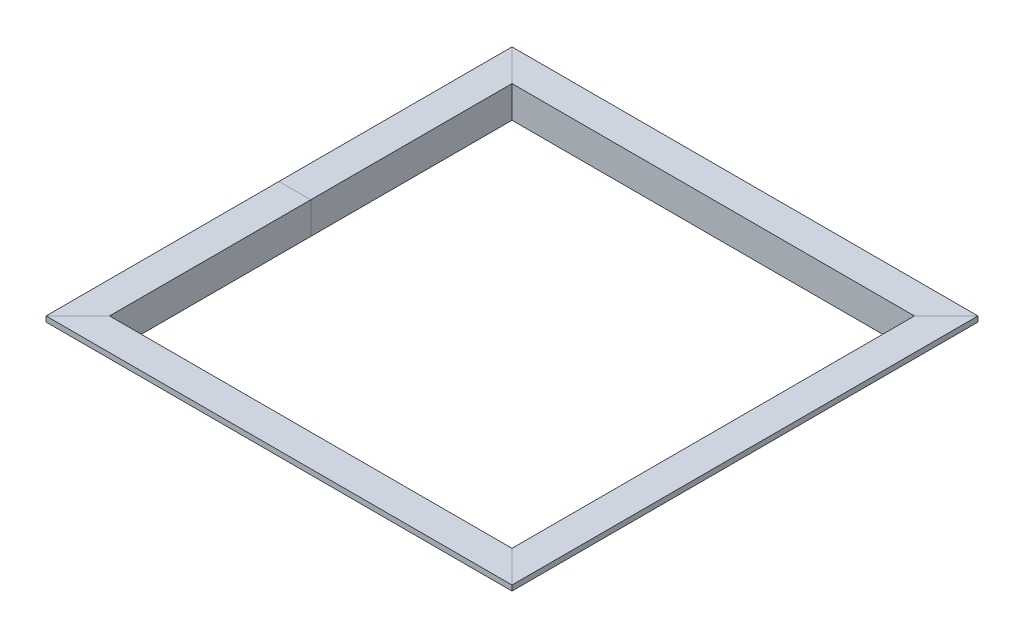
ISO-10303-21;
HEADER;
FILE_DESCRIPTION(('STEP AP214'),'2;1');
FILE_NAME('part.step','',(''),(''),'','','');
FILE_SCHEMA(('AUTOMOTIVE_DESIGN { 1 0 10303 214 1 1 1 1 }'));
ENDSEC;
DATA;
#1=APPLICATION_CONTEXT('core data for automotive mechanical design processes');
#2=APPLICATION_PROTOCOL_DEFINITION('international standard','automotive_design',2000,#1);
#3=PRODUCT_CONTEXT('',#1,'mechanical');
#4=PRODUCT('Part','Part','',(#3));
#5=PRODUCT_RELATED_PRODUCT_CATEGORY('part','',(#4));
#6=PRODUCT_DEFINITION_FORMATION('','',#4);
#7=PRODUCT_DEFINITION_CONTEXT('part definition',#1,'design');
#8=PRODUCT_DEFINITION('design','',#6,#7);
#9=PRODUCT_DEFINITION_SHAPE('','',#8);
#10=(LENGTH_UNIT() NAMED_UNIT(*) SI_UNIT(.MILLI.,.METRE.));
#11=(NAMED_UNIT(*) PLANE_ANGLE_UNIT() SI_UNIT($,.RADIAN.));
#12=(NAMED_UNIT(*) SI_UNIT($,.STERADIAN.) SOLID_ANGLE_UNIT());
#13=UNCERTAINTY_MEASURE_WITH_UNIT(LENGTH_MEASURE(1.E-05),#10,'distance_accuracy_value','');
#14=(GEOMETRIC_REPRESENTATION_CONTEXT(3) GLOBAL_UNCERTAINTY_ASSIGNED_CONTEXT((#13)) GLOBAL_UNIT_ASSIGNED_CONTEXT((#10,
#11,#12)) REPRESENTATION_CONTEXT('',''));
#15=CARTESIAN_POINT('',(0.,0.,0.));
#16=DIRECTION('',(0.,0.,1.));
#17=DIRECTION('',(1.,0.,0.));
#18=AXIS2_PLACEMENT_3D('',#15,#16,#17);
#19=CARTESIAN_POINT('',(279.4,-6.35,279.4));
#20=DIRECTION('',(0.,0.,-1.));
#21=DIRECTION('',(-1.,0.,0.));
#22=AXIS2_PLACEMENT_3D('',#19,#20,#21);
#23=PLANE('',#22);
#24=DIRECTION('',(-1.,0.,0.));
#25=VECTOR('',#24,1.);
#26=CARTESIAN_POINT('',(279.4,-6.35,279.4));
#27=LINE('',#26,#25);
#28=CARTESIAN_POINT('',(279.4,-6.35,279.4));
#29=VERTEX_POINT('',#28);
#30=CARTESIAN_POINT('',(-279.4,-6.35,279.4));
#31=VERTEX_POINT('',#30);
#32=EDGE_CURVE('E178',#29,#31,#27,.T.);
#33=ORIENTED_EDGE('',*,*,#32,.F.);
#34=DIRECTION('',(0.,-1.,0.));
#35=VECTOR('',#34,1.);
#36=CARTESIAN_POINT('',(279.4,-6.35,279.4));
#37=LINE('',#36,#35);
#38=CARTESIAN_POINT('',(279.4,0.,279.4));
#39=VERTEX_POINT('',#38);
#40=EDGE_CURVE('E253',#39,#29,#37,.T.);
#41=ORIENTED_EDGE('',*,*,#40,.F.);
#42=DIRECTION('',(-1.,0.,0.));
#43=VECTOR('',#42,1.);
#44=CARTESIAN_POINT('',(279.4,0.,279.4));
#45=LINE('',#44,#43);
#46=CARTESIAN_POINT('',(-279.4,0.,279.4));
#47=VERTEX_POINT('',#46);
#48=EDGE_CURVE('E136',#39,#47,#45,.T.);
#49=ORIENTED_EDGE('',*,*,#48,.T.);
#50=DIRECTION('',(0.,-1.,0.));
#51=VECTOR('',#50,1.);
#52=CARTESIAN_POINT('',(-279.4,-6.35,279.4));
#53=LINE('',#52,#51);
#54=EDGE_CURVE('E175',#47,#31,#53,.T.);
#55=ORIENTED_EDGE('',*,*,#54,.T.);
#56=EDGE_LOOP('',(#33,#41,#49,#55));
#57=FACE_BOUND('',#56,.T.);
#58=ADVANCED_FACE('F33',(#57),#23,.F.);
#59=CARTESIAN_POINT('',(279.4,-38.1,247.65));
#60=DIRECTION('',(0.,0.,-1.));
#61=DIRECTION('',(-1.,0.,0.));
#62=AXIS2_PLACEMENT_3D('',#59,#60,#61);
#63=PLANE('',#62);
#64=DIRECTION('',(-1.,0.,0.));
#65=VECTOR('',#64,1.);
#66=CARTESIAN_POINT('',(279.4,-38.1,247.65));
#67=LINE('',#66,#65);
#68=CARTESIAN_POINT('',(247.65,-38.1,247.65));
#69=VERTEX_POINT('',#68);
#70=CARTESIAN_POINT('',(-247.65,-38.1,247.65));
#71=VERTEX_POINT('',#70);
#72=EDGE_CURVE('E207',#69,#71,#67,.T.);
#73=ORIENTED_EDGE('',*,*,#72,.F.);
#74=DIRECTION('',(0.,1.,0.));
#75=VECTOR('',#74,1.);
#76=CARTESIAN_POINT('',(247.65,-38.1,247.65));
#77=LINE('',#76,#75);
#78=CARTESIAN_POINT('',(247.65,-6.35,247.65));
#79=VERTEX_POINT('',#78);
#80=EDGE_CURVE('E241',#69,#79,#77,.T.);
#81=ORIENTED_EDGE('',*,*,#80,.T.);
#82=DIRECTION('',(-1.,0.,0.));
#83=VECTOR('',#82,1.);
#84=CARTESIAN_POINT('',(279.4,-6.35,247.65));
#85=LINE('',#84,#83);
#86=CARTESIAN_POINT('',(-247.65,-6.35,247.65));
#87=VERTEX_POINT('',#86);
#88=EDGE_CURVE('E204',#79,#87,#85,.T.);
#89=ORIENTED_EDGE('',*,*,#88,.T.);
#90=DIRECTION('',(0.,1.,0.));
#91=VECTOR('',#90,1.);
#92=CARTESIAN_POINT('',(-247.65,-38.1,247.65));
#93=LINE('',#92,#91);
#94=EDGE_CURVE('E155',#71,#87,#93,.T.);
#95=ORIENTED_EDGE('',*,*,#94,.F.);
#96=EDGE_LOOP('',(#73,#81,#89,#95));
#97=FACE_BOUND('',#96,.T.);
#98=ADVANCED_FACE('F220',(#97),#63,.F.);
#99=CARTESIAN_POINT('',(279.4,-38.1,241.3));
#100=DIRECTION('',(0.,1.,0.));
#101=DIRECTION('',(0.,0.,1.));
#102=AXIS2_PLACEMENT_3D('',#99,#100,#101);
#103=PLANE('',#102);
#104=DIRECTION('',(-1.,0.,0.));
#105=VECTOR('',#104,1.);
#106=CARTESIAN_POINT('',(279.4,-38.1,241.3));
#107=LINE('',#106,#105);
#108=CARTESIAN_POINT('',(241.3,-38.1,241.3));
#109=VERTEX_POINT('',#108);
#110=CARTESIAN_POINT('',(-241.3,-38.1,241.3));
#111=VERTEX_POINT('',#110);
#112=EDGE_CURVE('E137',#109,#111,#107,.T.);
#113=ORIENTED_EDGE('',*,*,#112,.F.);
#114=DIRECTION('',(0.707106781186548,0.,0.707106781186548));
#115=VECTOR('',#114,1.);
#116=CARTESIAN_POINT('',(-19.05,-38.0999999999997,-19.0500000000002));
#117=LINE('',#116,#115);
#118=EDGE_CURVE('E215',#109,#69,#117,.T.);
#119=ORIENTED_EDGE('',*,*,#118,.T.);
#120=ORIENTED_EDGE('',*,*,#72,.T.);
#121=DIRECTION('',(-0.707106781186547,0.,0.707106781186548));
#122=VECTOR('',#121,1.);
#123=CARTESIAN_POINT('',(-260.35,-38.1,260.35));
#124=LINE('',#123,#122);
#125=EDGE_CURVE('E141',#111,#71,#124,.T.);
#126=ORIENTED_EDGE('',*,*,#125,.F.);
#127=EDGE_LOOP('',(#113,#119,#120,#126));
#128=FACE_BOUND('',#127,.T.);
#129=ADVANCED_FACE('F213',(#128),#103,.F.);
#130=CARTESIAN_POINT('',(279.4,0.,241.3));
#131=DIRECTION('',(0.,0.,1.));
#132=DIRECTION('',(0.,-1.,0.));
#133=AXIS2_PLACEMENT_3D('',#130,#131,#132);
#134=PLANE('',#133);
#135=DIRECTION('',(-1.,0.,0.));
#136=VECTOR('',#135,1.);
#137=CARTESIAN_POINT('',(279.4,0.,241.3));
#138=LINE('',#137,#136);
#139=CARTESIAN_POINT('',(241.3,0.,241.3));
#140=VERTEX_POINT('',#139);
#141=CARTESIAN_POINT('',(-241.3,0.,241.3));
#142=VERTEX_POINT('',#141);
#143=EDGE_CURVE('E37',#140,#142,#138,.T.);
#144=ORIENTED_EDGE('',*,*,#143,.F.);
#145=DIRECTION('',(0.,-1.,0.));
#146=VECTOR('',#145,1.);
#147=CARTESIAN_POINT('',(241.3,-3.79326200080262E-13,241.3));
#148=LINE('',#147,#146);
#149=EDGE_CURVE('E246',#140,#109,#148,.T.);
#150=ORIENTED_EDGE('',*,*,#149,.T.);
#151=ORIENTED_EDGE('',*,*,#112,.T.);
#152=DIRECTION('',(0.,-1.,0.));
#153=VECTOR('',#152,1.);
#154=CARTESIAN_POINT('',(-241.3,0.,241.3));
#155=LINE('',#154,#153);
#156=EDGE_CURVE('E111',#142,#111,#155,.T.);
#157=ORIENTED_EDGE('',*,*,#156,.F.);
#158=EDGE_LOOP('',(#144,#150,#151,#157));
#159=FACE_BOUND('',#158,.T.);
#160=ADVANCED_FACE('F138',(#159),#134,.F.);
#161=CARTESIAN_POINT('',(279.4,0.,279.4));
#162=DIRECTION('',(0.,-1.,0.));
#163=DIRECTION('',(0.,0.,-1.));
#164=AXIS2_PLACEMENT_3D('',#161,#162,#163);
#165=PLANE('',#164);
#166=ORIENTED_EDGE('',*,*,#48,.F.);
#167=DIRECTION('',(-0.707106781186548,0.,-0.707106781186548));
#168=VECTOR('',#167,1.);
#169=CARTESIAN_POINT('',(0.,0.,-1.66533453693773E-13));
#170=LINE('',#169,#168);
#171=EDGE_CURVE('E132',#39,#140,#170,.T.);
#172=ORIENTED_EDGE('',*,*,#171,.T.);
#173=ORIENTED_EDGE('',*,*,#143,.T.);
#174=DIRECTION('',(0.707106781186547,0.,-0.707106781186548));
#175=VECTOR('',#174,1.);
#176=CARTESIAN_POINT('',(-279.4,0.,279.4));
#177=LINE('',#176,#175);
#178=EDGE_CURVE('E117',#47,#142,#177,.T.);
#179=ORIENTED_EDGE('',*,*,#178,.F.);
#180=EDGE_LOOP('',(#166,#172,#173,#179));
#181=FACE_BOUND('',#180,.T.);
#182=ADVANCED_FACE('F131',(#181),#165,.F.);
#183=CARTESIAN_POINT('',(279.4,-6.35,247.65));
#184=DIRECTION('',(0.,1.,0.));
#185=DIRECTION('',(0.,0.,1.));
#186=AXIS2_PLACEMENT_3D('',#183,#184,#185);
#187=PLANE('',#186);
#188=ORIENTED_EDGE('',*,*,#88,.F.);
#189=DIRECTION('',(0.707106781186548,0.,0.707106781186548));
#190=VECTOR('',#189,1.);
#191=CARTESIAN_POINT('',(-15.875,-6.34999999999996,-15.8750000000002));
#192=LINE('',#191,#190);
#193=EDGE_CURVE('E127',#79,#29,#192,.T.);
#194=ORIENTED_EDGE('',*,*,#193,.T.);
#195=ORIENTED_EDGE('',*,*,#32,.T.);
#196=DIRECTION('',(-0.707106781186547,0.,0.707106781186548));
#197=VECTOR('',#196,1.);
#198=CARTESIAN_POINT('',(-263.525,-6.35,263.525));
#199=LINE('',#198,#197);
#200=EDGE_CURVE('E157',#87,#31,#199,.T.);
#201=ORIENTED_EDGE('',*,*,#200,.F.);
#202=EDGE_LOOP('',(#188,#194,#195,#201));
#203=FACE_BOUND('',#202,.T.);
#204=ADVANCED_FACE('F35',(#203),#187,.F.);
#205=CARTESIAN_POINT('',(-247.65,-38.1,279.4));
#206=DIRECTION('',(1.,0.,0.));
#207=DIRECTION('',(0.,0.,-1.));
#208=AXIS2_PLACEMENT_3D('',#205,#206,#207);
#209=PLANE('',#208);
#210=ORIENTED_EDGE('',*,*,#94,.T.);
#211=DIRECTION('',(0.,0.,-1.));
#212=VECTOR('',#211,1.);
#213=CARTESIAN_POINT('',(-247.65,-6.35,279.4));
#214=LINE('',#213,#212);
#215=CARTESIAN_POINT('',(-247.65,-6.35,0.));
#216=VERTEX_POINT('',#215);
#217=EDGE_CURVE('E165',#87,#216,#214,.T.);
#218=ORIENTED_EDGE('',*,*,#217,.T.);
#219=DIRECTION('',(0.,-1.,0.));
#220=VECTOR('',#219,1.);
#221=CARTESIAN_POINT('',(-247.65,-38.1,0.));
#222=LINE('',#221,#220);
#223=CARTESIAN_POINT('',(-247.65,-38.1,0.));
#224=VERTEX_POINT('',#223);
#225=EDGE_CURVE('E161',#216,#224,#222,.T.);
#226=ORIENTED_EDGE('',*,*,#225,.T.);
#227=DIRECTION('',(0.,0.,-1.));
#228=VECTOR('',#227,1.);
#229=CARTESIAN_POINT('',(-247.65,-38.1,279.4));
#230=LINE('',#229,#228);
#231=EDGE_CURVE('E164',#71,#224,#230,.T.);
#232=ORIENTED_EDGE('',*,*,#231,.F.);
#233=EDGE_LOOP('',(#210,#218,#226,#232));
#234=FACE_BOUND('',#233,.T.);
#235=ADVANCED_FACE('F224',(#234),#209,.F.);
#236=CARTESIAN_POINT('',(-241.3,-38.1,279.4));
#237=DIRECTION('',(0.,1.,0.));
#238=DIRECTION('',(-1.,0.,0.));
#239=AXIS2_PLACEMENT_3D('',#236,#237,#238);
#240=PLANE('',#239);
#241=ORIENTED_EDGE('',*,*,#125,.T.);
#242=ORIENTED_EDGE('',*,*,#231,.T.);
#243=DIRECTION('',(1.,0.,0.));
#244=VECTOR('',#243,1.);
#245=CARTESIAN_POINT('',(-241.3,-38.1,0.));
#246=LINE('',#245,#244);
#247=CARTESIAN_POINT('',(-241.3,-38.1,0.));
#248=VERTEX_POINT('',#247);
#249=EDGE_CURVE('E166',#224,#248,#246,.T.);
#250=ORIENTED_EDGE('',*,*,#249,.T.);
#251=DIRECTION('',(0.,0.,-1.));
#252=VECTOR('',#251,1.);
#253=CARTESIAN_POINT('',(-241.3,-38.1,279.4));
#254=LINE('',#253,#252);
#255=EDGE_CURVE('E150',#111,#248,#254,.T.);
#256=ORIENTED_EDGE('',*,*,#255,.F.);
#257=EDGE_LOOP('',(#241,#242,#250,#256));
#258=FACE_BOUND('',#257,.T.);
#259=ADVANCED_FACE('F423',(#258),#240,.F.);
#260=CARTESIAN_POINT('',(-241.3,0.,279.4));
#261=DIRECTION('',(-1.,0.,0.));
#262=DIRECTION('',(0.,-1.,0.));
#263=AXIS2_PLACEMENT_3D('',#260,#261,#262);
#264=PLANE('',#263);
#265=ORIENTED_EDGE('',*,*,#156,.T.);
#266=ORIENTED_EDGE('',*,*,#255,.T.);
#267=DIRECTION('',(0.,1.,0.));
#268=VECTOR('',#267,1.);
#269=CARTESIAN_POINT('',(-241.3,0.,0.));
#270=LINE('',#269,#268);
#271=CARTESIAN_POINT('',(-241.3,0.,0.));
#272=VERTEX_POINT('',#271);
#273=EDGE_CURVE('E146',#248,#272,#270,.T.);
#274=ORIENTED_EDGE('',*,*,#273,.T.);
#275=DIRECTION('',(0.,0.,-1.));
#276=VECTOR('',#275,1.);
#277=CARTESIAN_POINT('',(-241.3,0.,279.4));
#278=LINE('',#277,#276);
#279=EDGE_CURVE('E121',#142,#272,#278,.T.);
#280=ORIENTED_EDGE('',*,*,#279,.F.);
#281=EDGE_LOOP('',(#265,#266,#274,#280));
#282=FACE_BOUND('',#281,.T.);
#283=ADVANCED_FACE('F144',(#282),#264,.F.);
#284=CARTESIAN_POINT('',(-279.4,0.,279.4));
#285=DIRECTION('',(0.,-1.,0.));
#286=DIRECTION('',(0.,0.,-1.));
#287=AXIS2_PLACEMENT_3D('',#284,#285,#286);
#288=PLANE('',#287);
#289=ORIENTED_EDGE('',*,*,#178,.T.);
#290=ORIENTED_EDGE('',*,*,#279,.T.);
#291=DIRECTION('',(-1.,0.,0.));
#292=VECTOR('',#291,1.);
#293=CARTESIAN_POINT('',(-279.4,0.,0.));
#294=LINE('',#293,#292);
#295=CARTESIAN_POINT('',(-279.4,0.,0.));
#296=VERTEX_POINT('',#295);
#297=EDGE_CURVE('E147',#272,#296,#294,.T.);
#298=ORIENTED_EDGE('',*,*,#297,.T.);
#299=DIRECTION('',(0.,0.,-1.));
#300=VECTOR('',#299,1.);
#301=CARTESIAN_POINT('',(-279.4,0.,279.4));
#302=LINE('',#301,#300);
#303=EDGE_CURVE('E124',#47,#296,#302,.T.);
#304=ORIENTED_EDGE('',*,*,#303,.F.);
#305=EDGE_LOOP('',(#289,#290,#298,#304));
#306=FACE_BOUND('',#305,.T.);
#307=ADVANCED_FACE('F119',(#306),#288,.F.);
#308=CARTESIAN_POINT('',(-279.4,-6.35,279.4));
#309=DIRECTION('',(1.,0.,0.));
#310=DIRECTION('',(0.,0.,-1.));
#311=AXIS2_PLACEMENT_3D('',#308,#309,#310);
#312=PLANE('',#311);
#313=DIRECTION('',(0.,0.,-1.));
#314=VECTOR('',#313,1.);
#315=CARTESIAN_POINT('',(-279.4,-6.35,279.4));
#316=LINE('',#315,#314);
#317=CARTESIAN_POINT('',(-279.4,-6.35,0.));
#318=VERTEX_POINT('',#317);
#319=EDGE_CURVE('E181',#31,#318,#316,.T.);
#320=ORIENTED_EDGE('',*,*,#319,.F.);
#321=ORIENTED_EDGE('',*,*,#54,.F.);
#322=ORIENTED_EDGE('',*,*,#303,.T.);
#323=DIRECTION('',(0.,-1.,0.));
#324=VECTOR('',#323,1.);
#325=CARTESIAN_POINT('',(-279.4,-6.35,0.));
#326=LINE('',#325,#324);
#327=EDGE_CURVE('E170',#296,#318,#326,.T.);
#328=ORIENTED_EDGE('',*,*,#327,.T.);
#329=EDGE_LOOP('',(#320,#321,#322,#328));
#330=FACE_BOUND('',#329,.T.);
#331=ADVANCED_FACE('F386',(#330),#312,.F.);
#332=CARTESIAN_POINT('',(-247.65,-6.35,279.4));
#333=DIRECTION('',(0.,1.,0.));
#334=DIRECTION('',(-1.,0.,0.));
#335=AXIS2_PLACEMENT_3D('',#332,#333,#334);
#336=PLANE('',#335);
#337=ORIENTED_EDGE('',*,*,#200,.T.);
#338=ORIENTED_EDGE('',*,*,#319,.T.);
#339=DIRECTION('',(1.,0.,0.));
#340=VECTOR('',#339,1.);
#341=CARTESIAN_POINT('',(-247.65,-6.35,0.));
#342=LINE('',#341,#340);
#343=EDGE_CURVE('E184',#318,#216,#342,.T.);
#344=ORIENTED_EDGE('',*,*,#343,.T.);
#345=ORIENTED_EDGE('',*,*,#217,.F.);
#346=EDGE_LOOP('',(#337,#338,#344,#345));
#347=FACE_BOUND('',#346,.T.);
#348=ADVANCED_FACE('F383',(#347),#336,.F.);
#349=CARTESIAN_POINT('',(-279.4,-6.35,0.));
#350=DIRECTION('',(1.,0.,0.));
#351=DIRECTION('',(0.,0.,-1.));
#352=AXIS2_PLACEMENT_3D('',#349,#350,#351);
#353=PLANE('',#352);
#354=DIRECTION('',(0.,0.,-1.));
#355=VECTOR('',#354,1.);
#356=CARTESIAN_POINT('',(-279.4,-6.35,0.));
#357=LINE('',#356,#355);
#358=CARTESIAN_POINT('',(-279.4,-6.35,-279.4));
#359=VERTEX_POINT('',#358);
#360=EDGE_CURVE('E160',#318,#359,#357,.T.);
#361=ORIENTED_EDGE('',*,*,#360,.F.);
#362=ORIENTED_EDGE('',*,*,#327,.F.);
#363=DIRECTION('',(0.,0.,-1.));
#364=VECTOR('',#363,1.);
#365=CARTESIAN_POINT('',(-279.4,0.,0.));
#366=LINE('',#365,#364);
#367=CARTESIAN_POINT('',(-279.4,0.,-279.4));
#368=VERTEX_POINT('',#367);
#369=EDGE_CURVE('E171',#296,#368,#366,.T.);
#370=ORIENTED_EDGE('',*,*,#369,.T.);
#371=DIRECTION('',(0.,-1.,0.));
#372=VECTOR('',#371,1.);
#373=CARTESIAN_POINT('',(-279.4,-6.35,-279.4));
#374=LINE('',#373,#372);
#375=EDGE_CURVE('E269',#368,#359,#374,.T.);
#376=ORIENTED_EDGE('',*,*,#375,.T.);
#377=EDGE_LOOP('',(#361,#362,#370,#376));
#378=FACE_BOUND('',#377,.T.);
#379=ADVANCED_FACE('F370',(#378),#353,.F.);
#380=CARTESIAN_POINT('',(-247.65,-38.1,0.));
#381=DIRECTION('',(1.,0.,0.));
#382=DIRECTION('',(0.,0.,-1.));
#383=AXIS2_PLACEMENT_3D('',#380,#381,#382);
#384=PLANE('',#383);
#385=DIRECTION('',(0.,0.,-1.));
#386=VECTOR('',#385,1.);
#387=CARTESIAN_POINT('',(-247.65,-38.1,0.));
#388=LINE('',#387,#386);
#389=CARTESIAN_POINT('',(-247.65,-38.1,-247.65));
#390=VERTEX_POINT('',#389);
#391=EDGE_CURVE('E192',#224,#390,#388,.T.);
#392=ORIENTED_EDGE('',*,*,#391,.F.);
#393=ORIENTED_EDGE('',*,*,#225,.F.);
#394=DIRECTION('',(0.,0.,-1.));
#395=VECTOR('',#394,1.);
#396=CARTESIAN_POINT('',(-247.65,-6.35,0.));
#397=LINE('',#396,#395);
#398=CARTESIAN_POINT('',(-247.65,-6.35,-247.65));
#399=VERTEX_POINT('',#398);
#400=EDGE_CURVE('E189',#216,#399,#397,.T.);
#401=ORIENTED_EDGE('',*,*,#400,.T.);
#402=DIRECTION('',(0.,1.,0.));
#403=VECTOR('',#402,1.);
#404=CARTESIAN_POINT('',(-247.65,-38.1,-247.65));
#405=LINE('',#404,#403);
#406=EDGE_CURVE('E270',#390,#399,#405,.T.);
#407=ORIENTED_EDGE('',*,*,#406,.F.);
#408=EDGE_LOOP('',(#392,#393,#401,#407));
#409=FACE_BOUND('',#408,.T.);
#410=ADVANCED_FACE('F362',(#409),#384,.F.);
#411=CARTESIAN_POINT('',(-241.3,-38.1,0.));
#412=DIRECTION('',(0.,1.,0.));
#413=DIRECTION('',(-1.,0.,0.));
#414=AXIS2_PLACEMENT_3D('',#411,#412,#413);
#415=PLANE('',#414);
#416=DIRECTION('',(0.,0.,-1.));
#417=VECTOR('',#416,1.);
#418=CARTESIAN_POINT('',(-241.3,-38.1,0.));
#419=LINE('',#418,#417);
#420=CARTESIAN_POINT('',(-241.3,-38.1,-241.3));
#421=VERTEX_POINT('',#420);
#422=EDGE_CURVE('E195',#248,#421,#419,.T.);
#423=ORIENTED_EDGE('',*,*,#422,.F.);
#424=ORIENTED_EDGE('',*,*,#249,.F.);
#425=ORIENTED_EDGE('',*,*,#391,.T.);
#426=DIRECTION('',(-0.707106781186548,0.,-0.707106781186547));
#427=VECTOR('',#426,1.);
#428=CARTESIAN_POINT('',(-260.35,-38.1,-260.35));
#429=LINE('',#428,#427);
#430=EDGE_CURVE('E274',#421,#390,#429,.T.);
#431=ORIENTED_EDGE('',*,*,#430,.F.);
#432=EDGE_LOOP('',(#423,#424,#425,#431));
#433=FACE_BOUND('',#432,.T.);
#434=ADVANCED_FACE('F360',(#433),#415,.F.);
#435=CARTESIAN_POINT('',(-241.3,0.,0.));
#436=DIRECTION('',(-1.,0.,0.));
#437=DIRECTION('',(0.,-1.,0.));
#438=AXIS2_PLACEMENT_3D('',#435,#436,#437);
#439=PLANE('',#438);
#440=DIRECTION('',(0.,0.,-1.));
#441=VECTOR('',#440,1.);
#442=CARTESIAN_POINT('',(-241.3,0.,0.));
#443=LINE('',#442,#441);
#444=CARTESIAN_POINT('',(-241.3,0.,-241.3));
#445=VERTEX_POINT('',#444);
#446=EDGE_CURVE('E174',#272,#445,#443,.T.);
#447=ORIENTED_EDGE('',*,*,#446,.F.);
#448=ORIENTED_EDGE('',*,*,#273,.F.);
#449=ORIENTED_EDGE('',*,*,#422,.T.);
#450=DIRECTION('',(0.,-1.,0.));
#451=VECTOR('',#450,1.);
#452=CARTESIAN_POINT('',(-241.3,0.,-241.3));
#453=LINE('',#452,#451);
#454=EDGE_CURVE('E277',#445,#421,#453,.T.);
#455=ORIENTED_EDGE('',*,*,#454,.F.);
#456=EDGE_LOOP('',(#447,#448,#449,#455));
#457=FACE_BOUND('',#456,.T.);
#458=ADVANCED_FACE('F352',(#457),#439,.F.);
#459=CARTESIAN_POINT('',(-279.4,0.,0.));
#460=DIRECTION('',(0.,-1.,0.));
#461=DIRECTION('',(0.,0.,-1.));
#462=AXIS2_PLACEMENT_3D('',#459,#460,#461);
#463=PLANE('',#462);
#464=ORIENTED_EDGE('',*,*,#369,.F.);
#465=ORIENTED_EDGE('',*,*,#297,.F.);
#466=ORIENTED_EDGE('',*,*,#446,.T.);
#467=DIRECTION('',(0.707106781186548,0.,0.707106781186547));
#468=VECTOR('',#467,1.);
#469=CARTESIAN_POINT('',(-279.4,0.,-279.4));
#470=LINE('',#469,#468);
#471=EDGE_CURVE('E252',#368,#445,#470,.T.);
#472=ORIENTED_EDGE('',*,*,#471,.F.);
#473=EDGE_LOOP('',(#464,#465,#466,#472));
#474=FACE_BOUND('',#473,.T.);
#475=ADVANCED_FACE('F350',(#474),#463,.F.);
#476=CARTESIAN_POINT('',(-247.65,-6.35,0.));
#477=DIRECTION('',(0.,1.,0.));
#478=DIRECTION('',(-1.,0.,0.));
#479=AXIS2_PLACEMENT_3D('',#476,#477,#478);
#480=PLANE('',#479);
#481=ORIENTED_EDGE('',*,*,#400,.F.);
#482=ORIENTED_EDGE('',*,*,#343,.F.);
#483=ORIENTED_EDGE('',*,*,#360,.T.);
#484=DIRECTION('',(-0.707106781186548,0.,-0.707106781186547));
#485=VECTOR('',#484,1.);
#486=CARTESIAN_POINT('',(-263.525,-6.35,-263.525));
#487=LINE('',#486,#485);
#488=EDGE_CURVE('E273',#399,#359,#487,.T.);
#489=ORIENTED_EDGE('',*,*,#488,.F.);
#490=EDGE_LOOP('',(#481,#482,#483,#489));
#491=FACE_BOUND('',#490,.T.);
#492=ADVANCED_FACE('F366',(#491),#480,.F.);
#493=CARTESIAN_POINT('',(279.4,-6.35,-279.4));
#494=DIRECTION('',(-1.,0.,0.));
#495=DIRECTION('',(0.,0.,1.));
#496=AXIS2_PLACEMENT_3D('',#493,#494,#495);
#497=PLANE('',#496);
#498=DIRECTION('',(0.,0.,1.));
#499=VECTOR('',#498,1.);
#500=CARTESIAN_POINT('',(279.4,-6.35,-279.4));
#501=LINE('',#500,#499);
#502=CARTESIAN_POINT('',(279.4,-6.35,-279.4));
#503=VERTEX_POINT('',#502);
#504=EDGE_CURVE('E249',#503,#29,#501,.T.);
#505=ORIENTED_EDGE('',*,*,#504,.F.);
#506=DIRECTION('',(0.,-1.,0.));
#507=VECTOR('',#506,1.);
#508=CARTESIAN_POINT('',(279.4,-6.35,-279.4));
#509=LINE('',#508,#507);
#510=CARTESIAN_POINT('',(279.4,0.,-279.4));
#511=VERTEX_POINT('',#510);
#512=EDGE_CURVE('E288',#511,#503,#509,.T.);
#513=ORIENTED_EDGE('',*,*,#512,.F.);
#514=DIRECTION('',(0.,0.,1.));
#515=VECTOR('',#514,1.);
#516=CARTESIAN_POINT('',(279.4,0.,-279.4));
#517=LINE('',#516,#515);
#518=EDGE_CURVE('E232',#511,#39,#517,.T.);
#519=ORIENTED_EDGE('',*,*,#518,.T.);
#520=ORIENTED_EDGE('',*,*,#40,.T.);
#521=EDGE_LOOP('',(#505,#513,#519,#520));
#522=FACE_BOUND('',#521,.T.);
#523=ADVANCED_FACE('F375',(#522),#497,.F.);
#524=CARTESIAN_POINT('',(247.65,-38.1,-279.4));
#525=DIRECTION('',(-1.,0.,0.));
#526=DIRECTION('',(0.,0.,1.));
#527=AXIS2_PLACEMENT_3D('',#524,#525,#526);
#528=PLANE('',#527);
#529=DIRECTION('',(0.,0.,1.));
#530=VECTOR('',#529,1.);
#531=CARTESIAN_POINT('',(247.65,-38.1,-279.4));
#532=LINE('',#531,#530);
#533=CARTESIAN_POINT('',(247.65,-38.1,-247.65));
#534=VERTEX_POINT('',#533);
#535=EDGE_CURVE('E236',#534,#69,#532,.T.);
#536=ORIENTED_EDGE('',*,*,#535,.F.);
#537=DIRECTION('',(0.,1.,0.));
#538=VECTOR('',#537,1.);
#539=CARTESIAN_POINT('',(247.65,-38.1,-247.65));
#540=LINE('',#539,#538);
#541=CARTESIAN_POINT('',(247.65,-6.35,-247.65));
#542=VERTEX_POINT('',#541);
#543=EDGE_CURVE('E287',#534,#542,#540,.T.);
#544=ORIENTED_EDGE('',*,*,#543,.T.);
#545=DIRECTION('',(0.,0.,1.));
#546=VECTOR('',#545,1.);
#547=CARTESIAN_POINT('',(247.65,-6.35,-279.4));
#548=LINE('',#547,#546);
#549=EDGE_CURVE('E238',#542,#79,#548,.T.);
#550=ORIENTED_EDGE('',*,*,#549,.T.);
#551=ORIENTED_EDGE('',*,*,#80,.F.);
#552=EDGE_LOOP('',(#536,#544,#550,#551));
#553=FACE_BOUND('',#552,.T.);
#554=ADVANCED_FACE('F306',(#553),#528,.F.);
#555=CARTESIAN_POINT('',(241.3,-38.1,-279.4));
#556=DIRECTION('',(0.,1.,0.));
#557=DIRECTION('',(-1.,0.,0.));
#558=AXIS2_PLACEMENT_3D('',#555,#556,#557);
#559=PLANE('',#558);
#560=DIRECTION('',(0.,0.,1.));
#561=VECTOR('',#560,1.);
#562=CARTESIAN_POINT('',(241.3,-38.1,-279.4));
#563=LINE('',#562,#561);
#564=CARTESIAN_POINT('',(241.3,-38.1,-241.3));
#565=VERTEX_POINT('',#564);
#566=EDGE_CURVE('E233',#565,#109,#563,.T.);
#567=ORIENTED_EDGE('',*,*,#566,.F.);
#568=DIRECTION('',(0.707106781186548,0.,-0.707106781186548));
#569=VECTOR('',#568,1.);
#570=CARTESIAN_POINT('',(-19.0500000000002,-38.0999999999997,19.05));
#571=LINE('',#570,#569);
#572=EDGE_CURVE('E299',#565,#534,#571,.T.);
#573=ORIENTED_EDGE('',*,*,#572,.T.);
#574=ORIENTED_EDGE('',*,*,#535,.T.);
#575=ORIENTED_EDGE('',*,*,#118,.F.);
#576=EDGE_LOOP('',(#567,#573,#574,#575));
#577=FACE_BOUND('',#576,.T.);
#578=ADVANCED_FACE('F407',(#577),#559,.F.);
#579=CARTESIAN_POINT('',(241.3,0.,-279.4));
#580=DIRECTION('',(1.,0.,0.));
#581=DIRECTION('',(0.,1.,0.));
#582=AXIS2_PLACEMENT_3D('',#579,#580,#581);
#583=PLANE('',#582);
#584=DIRECTION('',(0.,0.,1.));
#585=VECTOR('',#584,1.);
#586=CARTESIAN_POINT('',(241.3,0.,-279.4));
#587=LINE('',#586,#585);
#588=CARTESIAN_POINT('',(241.3,0.,-241.3));
#589=VERTEX_POINT('',#588);
#590=EDGE_CURVE('E230',#589,#140,#587,.T.);
#591=ORIENTED_EDGE('',*,*,#590,.F.);
#592=DIRECTION('',(0.,-1.,0.));
#593=VECTOR('',#592,1.);
#594=CARTESIAN_POINT('',(241.3,-3.79326200080262E-13,-241.3));
#595=LINE('',#594,#593);
#596=EDGE_CURVE('E296',#589,#565,#595,.T.);
#597=ORIENTED_EDGE('',*,*,#596,.T.);
#598=ORIENTED_EDGE('',*,*,#566,.T.);
#599=ORIENTED_EDGE('',*,*,#149,.F.);
#600=EDGE_LOOP('',(#591,#597,#598,#599));
#601=FACE_BOUND('',#600,.T.);
#602=ADVANCED_FACE('F339',(#601),#583,.F.);
#603=CARTESIAN_POINT('',(279.4,0.,-279.4));
#604=DIRECTION('',(0.,-1.,0.));
#605=DIRECTION('',(0.,0.,-1.));
#606=AXIS2_PLACEMENT_3D('',#603,#604,#605);
#607=PLANE('',#606);
#608=ORIENTED_EDGE('',*,*,#518,.F.);
#609=DIRECTION('',(-0.707106781186548,0.,0.707106781186548));
#610=VECTOR('',#609,1.);
#611=CARTESIAN_POINT('',(-1.66533453693773E-13,0.,0.));
#612=LINE('',#611,#610);
#613=EDGE_CURVE('E43',#511,#589,#612,.T.);
#614=ORIENTED_EDGE('',*,*,#613,.T.);
#615=ORIENTED_EDGE('',*,*,#590,.T.);
#616=ORIENTED_EDGE('',*,*,#171,.F.);
#617=EDGE_LOOP('',(#608,#614,#615,#616));
#618=FACE_BOUND('',#617,.T.);
#619=ADVANCED_FACE('F341',(#618),#607,.F.);
#620=CARTESIAN_POINT('',(247.65,-6.35,-279.4));
#621=DIRECTION('',(0.,1.,0.));
#622=DIRECTION('',(-1.,0.,0.));
#623=AXIS2_PLACEMENT_3D('',#620,#621,#622);
#624=PLANE('',#623);
#625=ORIENTED_EDGE('',*,*,#549,.F.);
#626=DIRECTION('',(0.707106781186548,0.,-0.707106781186548));
#627=VECTOR('',#626,1.);
#628=CARTESIAN_POINT('',(-15.8750000000002,-6.34999999999996,15.875));
#629=LINE('',#628,#627);
#630=EDGE_CURVE('E11',#542,#503,#629,.T.);
#631=ORIENTED_EDGE('',*,*,#630,.T.);
#632=ORIENTED_EDGE('',*,*,#504,.T.);
#633=ORIENTED_EDGE('',*,*,#193,.F.);
#634=EDGE_LOOP('',(#625,#631,#632,#633));
#635=FACE_BOUND('',#634,.T.);
#636=ADVANCED_FACE('F379',(#635),#624,.F.);
#637=CARTESIAN_POINT('',(-279.4,-6.35,-279.4));
#638=DIRECTION('',(0.,0.,1.));
#639=DIRECTION('',(1.,0.,0.));
#640=AXIS2_PLACEMENT_3D('',#637,#638,#639);
#641=PLANE('',#640);
#642=DIRECTION('',(1.,0.,0.));
#643=VECTOR('',#642,1.);
#644=CARTESIAN_POINT('',(-279.4,-6.35,-279.4));
#645=LINE('',#644,#643);
#646=EDGE_CURVE('E284',#359,#503,#645,.T.);
#647=ORIENTED_EDGE('',*,*,#646,.F.);
#648=ORIENTED_EDGE('',*,*,#375,.F.);
#649=DIRECTION('',(1.,0.,0.));
#650=VECTOR('',#649,1.);
#651=CARTESIAN_POINT('',(-279.4,0.,-279.4));
#652=LINE('',#651,#650);
#653=EDGE_CURVE('E259',#368,#511,#652,.T.);
#654=ORIENTED_EDGE('',*,*,#653,.T.);
#655=ORIENTED_EDGE('',*,*,#512,.T.);
#656=EDGE_LOOP('',(#647,#648,#654,#655));
#657=FACE_BOUND('',#656,.T.);
#658=ADVANCED_FACE('F372',(#657),#641,.F.);
#659=CARTESIAN_POINT('',(-279.4,-38.1,-247.65));
#660=DIRECTION('',(0.,0.,1.));
#661=DIRECTION('',(1.,0.,0.));
#662=AXIS2_PLACEMENT_3D('',#659,#660,#661);
#663=PLANE('',#662);
#664=ORIENTED_EDGE('',*,*,#406,.T.);
#665=DIRECTION('',(1.,0.,0.));
#666=VECTOR('',#665,1.);
#667=CARTESIAN_POINT('',(-279.4,-6.35,-247.65));
#668=LINE('',#667,#666);
#669=EDGE_CURVE('E266',#399,#542,#668,.T.);
#670=ORIENTED_EDGE('',*,*,#669,.T.);
#671=ORIENTED_EDGE('',*,*,#543,.F.);
#672=DIRECTION('',(1.,0.,0.));
#673=VECTOR('',#672,1.);
#674=CARTESIAN_POINT('',(-279.4,-38.1,-247.65));
#675=LINE('',#674,#673);
#676=EDGE_CURVE('E263',#390,#534,#675,.T.);
#677=ORIENTED_EDGE('',*,*,#676,.F.);
#678=EDGE_LOOP('',(#664,#670,#671,#677));
#679=FACE_BOUND('',#678,.T.);
#680=ADVANCED_FACE('F312',(#679),#663,.F.);
#681=CARTESIAN_POINT('',(-279.4,-38.1,-241.3));
#682=DIRECTION('',(0.,1.,0.));
#683=DIRECTION('',(0.,0.,1.));
#684=AXIS2_PLACEMENT_3D('',#681,#682,#683);
#685=PLANE('',#684);
#686=ORIENTED_EDGE('',*,*,#430,.T.);
#687=ORIENTED_EDGE('',*,*,#676,.T.);
#688=ORIENTED_EDGE('',*,*,#572,.F.);
#689=DIRECTION('',(1.,0.,0.));
#690=VECTOR('',#689,1.);
#691=CARTESIAN_POINT('',(-279.4,-38.1,-241.3));
#692=LINE('',#691,#690);
#693=EDGE_CURVE('E260',#421,#565,#692,.T.);
#694=ORIENTED_EDGE('',*,*,#693,.F.);
#695=EDGE_LOOP('',(#686,#687,#688,#694));
#696=FACE_BOUND('',#695,.T.);
#697=ADVANCED_FACE('F357',(#696),#685,.F.);
#698=CARTESIAN_POINT('',(-279.4,0.,-241.3));
#699=DIRECTION('',(0.,0.,-1.));
#700=DIRECTION('',(0.,1.,0.));
#701=AXIS2_PLACEMENT_3D('',#698,#699,#700);
#702=PLANE('',#701);
#703=ORIENTED_EDGE('',*,*,#454,.T.);
#704=ORIENTED_EDGE('',*,*,#693,.T.);
#705=ORIENTED_EDGE('',*,*,#596,.F.);
#706=DIRECTION('',(1.,0.,0.));
#707=VECTOR('',#706,1.);
#708=CARTESIAN_POINT('',(-279.4,0.,-241.3));
#709=LINE('',#708,#707);
#710=EDGE_CURVE('E257',#445,#589,#709,.T.);
#711=ORIENTED_EDGE('',*,*,#710,.F.);
#712=EDGE_LOOP('',(#703,#704,#705,#711));
#713=FACE_BOUND('',#712,.T.);
#714=ADVANCED_FACE('F336',(#713),#702,.F.);
#715=CARTESIAN_POINT('',(-279.4,0.,-279.4));
#716=DIRECTION('',(0.,-1.,0.));
#717=DIRECTION('',(0.,0.,-1.));
#718=AXIS2_PLACEMENT_3D('',#715,#716,#717);
#719=PLANE('',#718);
#720=ORIENTED_EDGE('',*,*,#471,.T.);
#721=ORIENTED_EDGE('',*,*,#710,.T.);
#722=ORIENTED_EDGE('',*,*,#613,.F.);
#723=ORIENTED_EDGE('',*,*,#653,.F.);
#724=EDGE_LOOP('',(#720,#721,#722,#723));
#725=FACE_BOUND('',#724,.T.);
#726=ADVANCED_FACE('F343',(#725),#719,.F.);
#727=CARTESIAN_POINT('',(-279.4,-6.35,-247.65));
#728=DIRECTION('',(0.,1.,0.));
#729=DIRECTION('',(0.,0.,1.));
#730=AXIS2_PLACEMENT_3D('',#727,#728,#729);
#731=PLANE('',#730);
#732=ORIENTED_EDGE('',*,*,#488,.T.);
#733=ORIENTED_EDGE('',*,*,#646,.T.);
#734=ORIENTED_EDGE('',*,*,#630,.F.);
#735=ORIENTED_EDGE('',*,*,#669,.F.);
#736=EDGE_LOOP('',(#732,#733,#734,#735));
#737=FACE_BOUND('',#736,.T.);
#738=ADVANCED_FACE('F316',(#737),#731,.F.);
#739=CLOSED_SHELL('',(#58,#98,#129,#160,#182,#204,#235,#259,#283,#307,#331,#348,#379,#410,#434,
#458,#475,#492,#523,#554,#578,#602,#619,#636,#658,#680,#697,#714,#726,#738));
#740=MANIFOLD_SOLID_BREP('B2',#739);
#741=ADVANCED_BREP_SHAPE_REPRESENTATION('',(#18,#740),#14);
#742=SHAPE_DEFINITION_REPRESENTATION(#9,#741);
ENDSEC;
END-ISO-10303-21;
